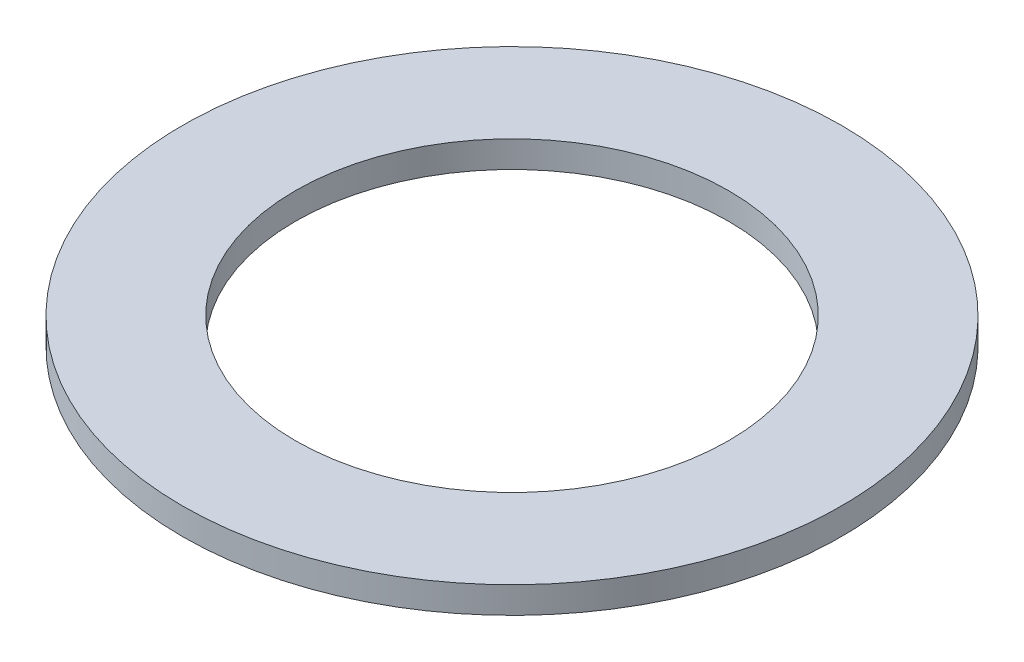
ISO-10303-21;
HEADER;
FILE_DESCRIPTION(('STEP AP214'),'2;1');
FILE_NAME('part.step','',(''),(''),'','','');
FILE_SCHEMA(('AUTOMOTIVE_DESIGN { 1 0 10303 214 1 1 1 1 }'));
ENDSEC;
DATA;
#1=APPLICATION_CONTEXT('core data for automotive mechanical design processes');
#2=APPLICATION_PROTOCOL_DEFINITION('international standard','automotive_design',2000,#1);
#3=PRODUCT_CONTEXT('',#1,'mechanical');
#4=PRODUCT('Part','Part','',(#3));
#5=PRODUCT_RELATED_PRODUCT_CATEGORY('part','',(#4));
#6=PRODUCT_DEFINITION_FORMATION('','',#4);
#7=PRODUCT_DEFINITION_CONTEXT('part definition',#1,'design');
#8=PRODUCT_DEFINITION('design','',#6,#7);
#9=PRODUCT_DEFINITION_SHAPE('','',#8);
#10=(LENGTH_UNIT() NAMED_UNIT(*) SI_UNIT(.MILLI.,.METRE.));
#11=(NAMED_UNIT(*) PLANE_ANGLE_UNIT() SI_UNIT($,.RADIAN.));
#12=(NAMED_UNIT(*) SI_UNIT($,.STERADIAN.) SOLID_ANGLE_UNIT());
#13=UNCERTAINTY_MEASURE_WITH_UNIT(LENGTH_MEASURE(1.E-05),#10,'distance_accuracy_value','');
#14=(GEOMETRIC_REPRESENTATION_CONTEXT(3) GLOBAL_UNCERTAINTY_ASSIGNED_CONTEXT((#13)) GLOBAL_UNIT_ASSIGNED_CONTEXT((#10,
#11,#12)) REPRESENTATION_CONTEXT('',''));
#15=CARTESIAN_POINT('',(0.,0.,0.));
#16=DIRECTION('',(0.,0.,1.));
#17=DIRECTION('',(1.,0.,0.));
#18=AXIS2_PLACEMENT_3D('',#15,#16,#17);
#19=CARTESIAN_POINT('',(0.,1.,0.));
#20=DIRECTION('',(0.,1.,0.));
#21=DIRECTION('',(0.,0.,1.));
#22=AXIS2_PLACEMENT_3D('',#19,#20,#21);
#23=PLANE('',#22);
#24=CARTESIAN_POINT('',(0.,1.,0.));
#25=DIRECTION('',(0.,1.,0.));
#26=DIRECTION('',(0.,0.,1.));
#27=AXIS2_PLACEMENT_3D('',#24,#25,#26);
#28=CIRCLE('',#27,12.4);
#29=CARTESIAN_POINT('',(0.,1.,12.4));
#30=VERTEX_POINT('',#29);
#31=EDGE_CURVE('E10',#30,#30,#28,.T.);
#32=ORIENTED_EDGE('',*,*,#31,.T.);
#33=EDGE_LOOP('',(#32));
#34=FACE_BOUND('',#33,.T.);
#35=CARTESIAN_POINT('',(0.,1.,0.));
#36=DIRECTION('',(0.,1.,0.));
#37=DIRECTION('',(0.,0.,1.));
#38=AXIS2_PLACEMENT_3D('',#35,#36,#37);
#39=CIRCLE('',#38,8.15);
#40=CARTESIAN_POINT('',(0.,1.,8.15));
#41=VERTEX_POINT('',#40);
#42=EDGE_CURVE('E54',#41,#41,#39,.T.);
#43=ORIENTED_EDGE('',*,*,#42,.F.);
#44=EDGE_LOOP('',(#43));
#45=FACE_BOUND('',#44,.T.);
#46=ADVANCED_FACE('F41',(#34,#45),#23,.T.);
#47=CARTESIAN_POINT('',(0.,0.,0.));
#48=DIRECTION('',(0.,1.,0.));
#49=DIRECTION('',(0.,0.,1.));
#50=AXIS2_PLACEMENT_3D('',#47,#48,#49);
#51=PLANE('',#50);
#52=CARTESIAN_POINT('',(0.,0.,0.));
#53=DIRECTION('',(0.,1.,0.));
#54=DIRECTION('',(0.,0.,1.));
#55=AXIS2_PLACEMENT_3D('',#52,#53,#54);
#56=CIRCLE('',#55,12.4);
#57=CARTESIAN_POINT('',(0.,0.,12.4));
#58=VERTEX_POINT('',#57);
#59=EDGE_CURVE('E45',#58,#58,#56,.T.);
#60=ORIENTED_EDGE('',*,*,#59,.F.);
#61=EDGE_LOOP('',(#60));
#62=FACE_BOUND('',#61,.T.);
#63=CARTESIAN_POINT('',(0.,0.,0.));
#64=DIRECTION('',(0.,1.,0.));
#65=DIRECTION('',(0.,0.,1.));
#66=AXIS2_PLACEMENT_3D('',#63,#64,#65);
#67=CIRCLE('',#66,8.15);
#68=CARTESIAN_POINT('',(0.,0.,8.15));
#69=VERTEX_POINT('',#68);
#70=EDGE_CURVE('E56',#69,#69,#67,.T.);
#71=ORIENTED_EDGE('',*,*,#70,.T.);
#72=EDGE_LOOP('',(#71));
#73=FACE_BOUND('',#72,.T.);
#74=ADVANCED_FACE('F68',(#62,#73),#51,.F.);
#75=CARTESIAN_POINT('',(0.,1.,0.));
#76=DIRECTION('',(0.,-1.,0.));
#77=DIRECTION('',(0.,0.,-1.));
#78=AXIS2_PLACEMENT_3D('',#75,#76,#77);
#79=CYLINDRICAL_SURFACE('',#78,12.4);
#80=ORIENTED_EDGE('',*,*,#31,.F.);
#81=EDGE_LOOP('',(#80));
#82=FACE_BOUND('',#81,.T.);
#83=ORIENTED_EDGE('',*,*,#59,.T.);
#84=EDGE_LOOP('',(#83));
#85=FACE_BOUND('',#84,.T.);
#86=ADVANCED_FACE('F43',(#82,#85),#79,.T.);
#87=CARTESIAN_POINT('',(0.,1.,0.));
#88=DIRECTION('',(0.,-1.,0.));
#89=DIRECTION('',(0.,0.,-1.));
#90=AXIS2_PLACEMENT_3D('',#87,#88,#89);
#91=CYLINDRICAL_SURFACE('',#90,8.15);
#92=ORIENTED_EDGE('',*,*,#42,.T.);
#93=EDGE_LOOP('',(#92));
#94=FACE_BOUND('',#93,.T.);
#95=ORIENTED_EDGE('',*,*,#70,.F.);
#96=EDGE_LOOP('',(#95));
#97=FACE_BOUND('',#96,.T.);
#98=ADVANCED_FACE('F64',(#94,#97),#91,.F.);
#99=CLOSED_SHELL('',(#46,#74,#86,#98));
#100=MANIFOLD_SOLID_BREP('B2',#99);
#101=ADVANCED_BREP_SHAPE_REPRESENTATION('',(#18,#100),#14);
#102=SHAPE_DEFINITION_REPRESENTATION(#9,#101);
ENDSEC;
END-ISO-10303-21;
